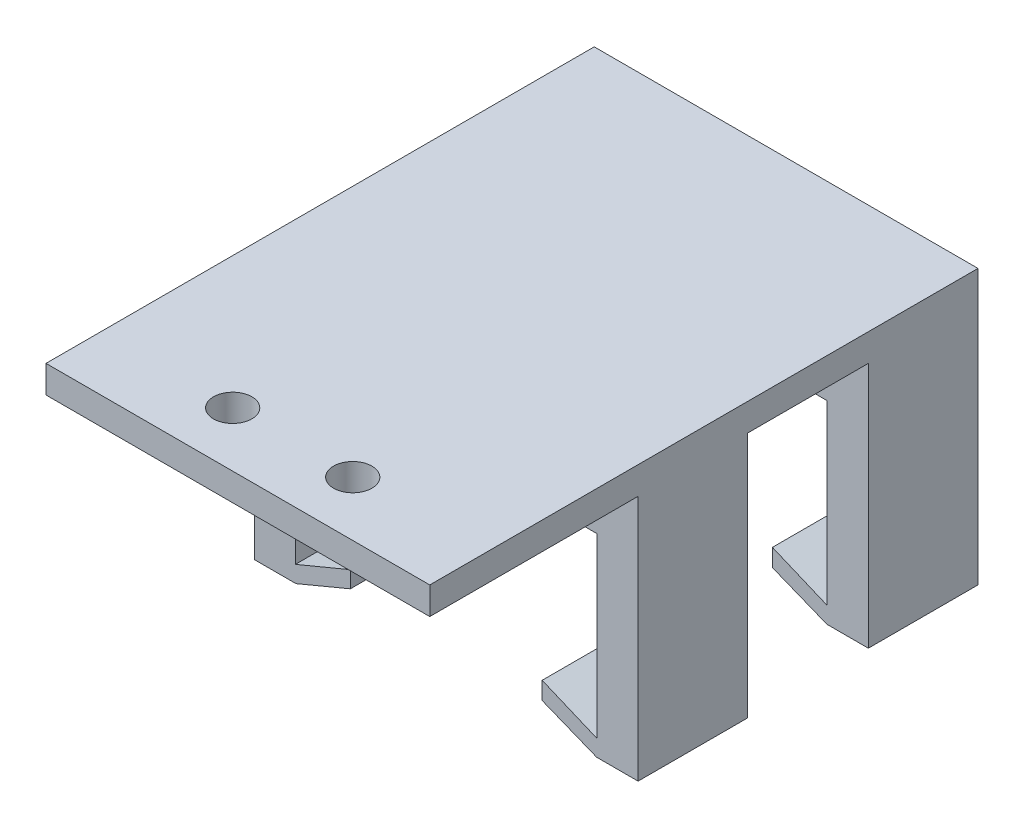
ISO-10303-21;
HEADER;
FILE_DESCRIPTION(('STEP AP214'),'2;1');
FILE_NAME('part.step','',(''),(''),'','','');
FILE_SCHEMA(('AUTOMOTIVE_DESIGN { 1 0 10303 214 1 1 1 1 }'));
ENDSEC;
DATA;
#1=APPLICATION_CONTEXT('core data for automotive mechanical design processes');
#2=APPLICATION_PROTOCOL_DEFINITION('international standard','automotive_design',2000,#1);
#3=PRODUCT_CONTEXT('',#1,'mechanical');
#4=PRODUCT('Part','Part','',(#3));
#5=PRODUCT_RELATED_PRODUCT_CATEGORY('part','',(#4));
#6=PRODUCT_DEFINITION_FORMATION('','',#4);
#7=PRODUCT_DEFINITION_CONTEXT('part definition',#1,'design');
#8=PRODUCT_DEFINITION('design','',#6,#7);
#9=PRODUCT_DEFINITION_SHAPE('','',#8);
#10=(LENGTH_UNIT() NAMED_UNIT(*) SI_UNIT(.MILLI.,.METRE.));
#11=(NAMED_UNIT(*) PLANE_ANGLE_UNIT() SI_UNIT($,.RADIAN.));
#12=(NAMED_UNIT(*) SI_UNIT($,.STERADIAN.) SOLID_ANGLE_UNIT());
#13=UNCERTAINTY_MEASURE_WITH_UNIT(LENGTH_MEASURE(1.E-05),#10,'distance_accuracy_value','');
#14=(GEOMETRIC_REPRESENTATION_CONTEXT(3) GLOBAL_UNCERTAINTY_ASSIGNED_CONTEXT((#13)) GLOBAL_UNIT_ASSIGNED_CONTEXT((#10,
#11,#12)) REPRESENTATION_CONTEXT('',''));
#15=CARTESIAN_POINT('',(0.,0.,0.));
#16=DIRECTION('',(0.,0.,1.));
#17=DIRECTION('',(1.,0.,0.));
#18=AXIS2_PLACEMENT_3D('',#15,#16,#17);
#19=CARTESIAN_POINT('',(20.2327480916031,-22.86,24.1350162162027));
#20=DIRECTION('',(1.,0.,0.));
#21=DIRECTION('',(0.,0.,-1.));
#22=AXIS2_PLACEMENT_3D('',#19,#20,#21);
#23=PLANE('',#22);
#24=DIRECTION('',(0.,0.,-1.));
#25=VECTOR('',#24,1.);
#26=CARTESIAN_POINT('',(20.2327480916031,-21.336,-12.4409837837973));
#27=LINE('',#26,#25);
#28=CARTESIAN_POINT('',(20.2327480916031,-21.336,-2.28098378379732));
#29=VERTEX_POINT('',#28);
#30=CARTESIAN_POINT('',(20.2327480916031,-21.336,-12.4409837837973));
#31=VERTEX_POINT('',#30);
#32=EDGE_CURVE('E296',#29,#31,#27,.T.);
#33=ORIENTED_EDGE('',*,*,#32,.F.);
#34=DIRECTION('',(0.,1.,0.));
#35=VECTOR('',#34,1.);
#36=CARTESIAN_POINT('',(20.2327480916031,-22.86,-2.28098378379732));
#37=LINE('',#36,#35);
#38=CARTESIAN_POINT('',(20.2327480916031,-4.9022,-2.28098378379732));
#39=VERTEX_POINT('',#38);
#40=EDGE_CURVE('E414',#29,#39,#37,.T.);
#41=ORIENTED_EDGE('',*,*,#40,.T.);
#42=DIRECTION('',(0.,0.,-1.));
#43=VECTOR('',#42,1.);
#44=CARTESIAN_POINT('',(20.2327480916031,-4.9022,24.1350162162027));
#45=LINE('',#44,#43);
#46=CARTESIAN_POINT('',(20.2327480916031,-4.9022,-12.4409837837973));
#47=VERTEX_POINT('',#46);
#48=EDGE_CURVE('E276',#39,#47,#45,.T.);
#49=ORIENTED_EDGE('',*,*,#48,.T.);
#50=DIRECTION('',(0.,1.,0.));
#51=VECTOR('',#50,1.);
#52=CARTESIAN_POINT('',(20.2327480916031,-22.86,-12.4409837837973));
#53=LINE('',#52,#51);
#54=EDGE_CURVE('E307',#31,#47,#53,.T.);
#55=ORIENTED_EDGE('',*,*,#54,.F.);
#56=EDGE_LOOP('',(#33,#41,#49,#55));
#57=FACE_BOUND('',#56,.T.);
#58=ADVANCED_FACE('F41',(#57),#23,.F.);
#59=CARTESIAN_POINT('',(-7.70725190839694,-22.86,24.1350162162027));
#60=DIRECTION('',(-1.,0.,0.));
#61=DIRECTION('',(0.,0.,1.));
#62=AXIS2_PLACEMENT_3D('',#59,#60,#61);
#63=PLANE('',#62);
#64=DIRECTION('',(0.,0.,1.));
#65=VECTOR('',#64,1.);
#66=CARTESIAN_POINT('',(-7.70725190839694,-4.9022,24.1350162162027));
#67=LINE('',#66,#65);
#68=CARTESIAN_POINT('',(-7.70725190839694,-4.9022,-12.4409837837973));
#69=VERTEX_POINT('',#68);
#70=CARTESIAN_POINT('',(-7.70725190839694,-4.9022,-2.28098378379731));
#71=VERTEX_POINT('',#70);
#72=EDGE_CURVE('E273',#69,#71,#67,.T.);
#73=ORIENTED_EDGE('',*,*,#72,.T.);
#74=DIRECTION('',(0.,-1.,0.));
#75=VECTOR('',#74,1.);
#76=CARTESIAN_POINT('',(-7.70725190839694,-22.86,-2.28098378379731));
#77=LINE('',#76,#75);
#78=CARTESIAN_POINT('',(-7.70725190839694,-21.336,-2.28098378379731));
#79=VERTEX_POINT('',#78);
#80=EDGE_CURVE('E419',#71,#79,#77,.T.);
#81=ORIENTED_EDGE('',*,*,#80,.T.);
#82=DIRECTION('',(0.,0.,1.));
#83=VECTOR('',#82,1.);
#84=CARTESIAN_POINT('',(-7.70725190839694,-21.336,24.1350162162027));
#85=LINE('',#84,#83);
#86=CARTESIAN_POINT('',(-7.70725190839694,-21.336,-12.4409837837973));
#87=VERTEX_POINT('',#86);
#88=EDGE_CURVE('E304',#87,#79,#85,.T.);
#89=ORIENTED_EDGE('',*,*,#88,.F.);
#90=DIRECTION('',(0.,1.,0.));
#91=VECTOR('',#90,1.);
#92=CARTESIAN_POINT('',(-7.70725190839694,-22.86,-12.4409837837973));
#93=LINE('',#92,#91);
#94=EDGE_CURVE('E322',#87,#69,#93,.T.);
#95=ORIENTED_EDGE('',*,*,#94,.T.);
#96=EDGE_LOOP('',(#73,#81,#89,#95));
#97=FACE_BOUND('',#96,.T.);
#98=ADVANCED_FACE('F454',(#97),#63,.F.);
#99=CARTESIAN_POINT('',(0.,-22.86,0.));
#100=DIRECTION('',(0.,-1.,0.));
#101=DIRECTION('',(0.,0.,-1.));
#102=AXIS2_PLACEMENT_3D('',#99,#100,#101);
#103=PLANE('',#102);
#104=DIRECTION('',(0.,0.,1.));
#105=VECTOR('',#104,1.);
#106=CARTESIAN_POINT('',(-7.66074574714831,-22.86,-12.4409837837973));
#107=LINE('',#106,#105);
#108=CARTESIAN_POINT('',(-7.66074574714831,-22.86,-12.4409837837973));
#109=VERTEX_POINT('',#108);
#110=CARTESIAN_POINT('',(-7.66074574714831,-22.86,-2.28098378379731));
#111=VERTEX_POINT('',#110);
#112=EDGE_CURVE('E239',#109,#111,#107,.T.);
#113=ORIENTED_EDGE('',*,*,#112,.T.);
#114=DIRECTION('',(1.,0.,0.));
#115=VECTOR('',#114,1.);
#116=CARTESIAN_POINT('',(-11.517251908397,-22.86,-2.28098378379731));
#117=LINE('',#116,#115);
#118=CARTESIAN_POINT('',(-11.517251908397,-22.86,-2.28098378379731));
#119=VERTEX_POINT('',#118);
#120=EDGE_CURVE('E391',#119,#111,#117,.T.);
#121=ORIENTED_EDGE('',*,*,#120,.F.);
#122=DIRECTION('',(0.,0.,-1.));
#123=VECTOR('',#122,1.);
#124=CARTESIAN_POINT('',(-11.5172519083969,-22.86,24.1350162162027));
#125=LINE('',#124,#123);
#126=CARTESIAN_POINT('',(-11.5172519083969,-22.86,-12.4409837837973));
#127=VERTEX_POINT('',#126);
#128=EDGE_CURVE('E316',#119,#127,#125,.T.);
#129=ORIENTED_EDGE('',*,*,#128,.T.);
#130=DIRECTION('',(1.,0.,0.));
#131=VECTOR('',#130,1.);
#132=CARTESIAN_POINT('',(-11.5172519083969,-22.86,-12.4409837837973));
#133=LINE('',#132,#131);
#134=EDGE_CURVE('E320',#127,#109,#133,.T.);
#135=ORIENTED_EDGE('',*,*,#134,.T.);
#136=EDGE_LOOP('',(#113,#121,#129,#135));
#137=FACE_BOUND('',#136,.T.);
#138=ADVANCED_FACE('F550',(#137),#103,.T.);
#139=CARTESIAN_POINT('',(0.,-22.86,0.));
#140=DIRECTION('',(0.,1.,0.));
#141=DIRECTION('',(0.,0.,1.));
#142=AXIS2_PLACEMENT_3D('',#139,#140,#141);
#143=PLANE('',#142);
#144=CARTESIAN_POINT('',(20.2048459047572,-22.86,-2.28098378379732));
#145=VERTEX_POINT('',#144);
#146=CARTESIAN_POINT('',(24.0427480916031,-22.86,-2.28098378379732));
#147=VERTEX_POINT('',#146);
#148=EDGE_CURVE('E397',#145,#147,#117,.T.);
#149=ORIENTED_EDGE('',*,*,#148,.F.);
#150=DIRECTION('',(0.,0.,1.));
#151=VECTOR('',#150,1.);
#152=CARTESIAN_POINT('',(20.2048459047573,-22.86,-12.4409837837973));
#153=LINE('',#152,#151);
#154=CARTESIAN_POINT('',(20.2048459047573,-22.86,-12.4409837837973));
#155=VERTEX_POINT('',#154);
#156=EDGE_CURVE('E56',#155,#145,#153,.T.);
#157=ORIENTED_EDGE('',*,*,#156,.F.);
#158=DIRECTION('',(1.,0.,0.));
#159=VECTOR('',#158,1.);
#160=CARTESIAN_POINT('',(24.0427480916031,-22.86,-12.4409837837973));
#161=LINE('',#160,#159);
#162=CARTESIAN_POINT('',(24.0427480916031,-22.86,-12.4409837837973));
#163=VERTEX_POINT('',#162);
#164=EDGE_CURVE('E310',#155,#163,#161,.T.);
#165=ORIENTED_EDGE('',*,*,#164,.T.);
#166=DIRECTION('',(0.,0.,1.));
#167=VECTOR('',#166,1.);
#168=CARTESIAN_POINT('',(24.0427480916031,-22.86,24.1350162162027));
#169=LINE('',#168,#167);
#170=EDGE_CURVE('E313',#163,#147,#169,.T.);
#171=ORIENTED_EDGE('',*,*,#170,.T.);
#172=EDGE_LOOP('',(#149,#157,#165,#171));
#173=FACE_BOUND('',#172,.T.);
#174=ADVANCED_FACE('F479',(#173),#143,.F.);
#175=CARTESIAN_POINT('',(15.1527480916031,0.,0.));
#176=DIRECTION('',(-1.,0.,0.));
#177=DIRECTION('',(0.,0.,1.));
#178=AXIS2_PLACEMENT_3D('',#175,#176,#177);
#179=PLANE('',#178);
#180=DIRECTION('',(0.,0.,1.));
#181=VECTOR('',#180,1.);
#182=CARTESIAN_POINT('',(15.1527480916031,-20.8346026362876,-12.4409837837973));
#183=LINE('',#182,#181);
#184=CARTESIAN_POINT('',(15.1527480916031,-20.8346026362876,-12.4409837837973));
#185=VERTEX_POINT('',#184);
#186=CARTESIAN_POINT('',(15.1527480916031,-20.8346026362876,-2.28098378379732));
#187=VERTEX_POINT('',#186);
#188=EDGE_CURVE('E471',#185,#187,#183,.T.);
#189=ORIENTED_EDGE('',*,*,#188,.T.);
#190=DIRECTION('',(0.,-1.,0.));
#191=VECTOR('',#190,1.);
#192=CARTESIAN_POINT('',(15.1527480916031,0.,-2.28098378379732));
#193=LINE('',#192,#191);
#194=CARTESIAN_POINT('',(15.1527480916031,-19.2088197799885,-2.28098378379732));
#195=VERTEX_POINT('',#194);
#196=EDGE_CURVE('E411',#195,#187,#193,.T.);
#197=ORIENTED_EDGE('',*,*,#196,.F.);
#198=DIRECTION('',(0.,0.,1.));
#199=VECTOR('',#198,1.);
#200=CARTESIAN_POINT('',(15.1527480916031,-19.2088197799885,-17.9796028196735));
#201=LINE('',#200,#199);
#202=CARTESIAN_POINT('',(15.1527480916031,-19.2088197799885,-12.4409837837973));
#203=VERTEX_POINT('',#202);
#204=EDGE_CURVE('E428',#203,#195,#201,.T.);
#205=ORIENTED_EDGE('',*,*,#204,.F.);
#206=DIRECTION('',(0.,-1.,0.));
#207=VECTOR('',#206,1.);
#208=CARTESIAN_POINT('',(15.1527480916031,-21.336,-12.4409837837973));
#209=LINE('',#208,#207);
#210=EDGE_CURVE('E297',#203,#185,#209,.T.);
#211=ORIENTED_EDGE('',*,*,#210,.T.);
#212=EDGE_LOOP('',(#189,#197,#205,#211));
#213=FACE_BOUND('',#212,.T.);
#214=ADVANCED_FACE('F470',(#213),#179,.T.);
#215=CARTESIAN_POINT('',(0.,-4.9022,0.));
#216=DIRECTION('',(0.,-1.,0.));
#217=DIRECTION('',(0.,0.,-1.));
#218=AXIS2_PLACEMENT_3D('',#215,#216,#217);
#219=PLANE('',#218);
#220=DIRECTION('',(1.,0.,0.));
#221=VECTOR('',#220,1.);
#222=CARTESIAN_POINT('',(0.,-4.9022,-2.28098378379732));
#223=LINE('',#222,#221);
#224=EDGE_CURVE('E417',#71,#39,#223,.T.);
#225=ORIENTED_EDGE('',*,*,#224,.F.);
#226=ORIENTED_EDGE('',*,*,#72,.F.);
#227=DIRECTION('',(1.,0.,0.));
#228=VECTOR('',#227,1.);
#229=CARTESIAN_POINT('',(-11.5172519083969,-4.9022,-12.4409837837973));
#230=LINE('',#229,#228);
#231=EDGE_CURVE('E260',#69,#47,#230,.T.);
#232=ORIENTED_EDGE('',*,*,#231,.T.);
#233=ORIENTED_EDGE('',*,*,#48,.F.);
#234=EDGE_LOOP('',(#225,#226,#232,#233));
#235=FACE_BOUND('',#234,.T.);
#236=ADVANCED_FACE('F457',(#235),#219,.T.);
#237=CARTESIAN_POINT('',(-7.70725190839694,-21.336,-17.9796028196735));
#238=DIRECTION('',(-0.384063284770582,0.923306770954936,0.));
#239=DIRECTION('',(-0.923306770954936,-0.384063284770582,0.));
#240=AXIS2_PLACEMENT_3D('',#237,#238,#239);
#241=PLANE('',#240);
#242=DIRECTION('',(-0.923306770954936,-0.384063284770582,0.));
#243=VECTOR('',#242,1.);
#244=CARTESIAN_POINT('',(-7.70725190839694,-21.336,-2.28098378379731));
#245=LINE('',#244,#243);
#246=CARTESIAN_POINT('',(-2.59340745083259,-19.2088197799885,-2.28098378379731));
#247=VERTEX_POINT('',#246);
#248=EDGE_CURVE('E422',#247,#79,#245,.T.);
#249=ORIENTED_EDGE('',*,*,#248,.F.);
#250=DIRECTION('',(0.,0.,1.));
#251=VECTOR('',#250,1.);
#252=CARTESIAN_POINT('',(-2.59340745083259,-19.2088197799885,-17.9796028196735));
#253=LINE('',#252,#251);
#254=CARTESIAN_POINT('',(-2.59340745083259,-19.2088197799885,-12.4409837837973));
#255=VERTEX_POINT('',#254);
#256=EDGE_CURVE('E265',#255,#247,#253,.T.);
#257=ORIENTED_EDGE('',*,*,#256,.F.);
#258=DIRECTION('',(0.923306770954936,0.384063284770582,0.));
#259=VECTOR('',#258,1.);
#260=CARTESIAN_POINT('',(-7.70725190839694,-21.336,-12.4409837837973));
#261=LINE('',#260,#259);
#262=EDGE_CURVE('E258',#87,#255,#261,.T.);
#263=ORIENTED_EDGE('',*,*,#262,.F.);
#264=ORIENTED_EDGE('',*,*,#88,.T.);
#265=EDGE_LOOP('',(#249,#257,#263,#264));
#266=FACE_BOUND('',#265,.T.);
#267=ADVANCED_FACE('F448',(#266),#241,.T.);
#268=CARTESIAN_POINT('',(-2.59340745083259,-19.2088197799885,-17.9796028196735));
#269=DIRECTION('',(0.999873452344455,-0.0159084661982286,0.));
#270=DIRECTION('',(0.0159084661982286,0.999873452344455,0.));
#271=AXIS2_PLACEMENT_3D('',#268,#269,#270);
#272=PLANE('',#271);
#273=DIRECTION('',(0.,0.,1.));
#274=VECTOR('',#273,1.);
#275=CARTESIAN_POINT('',(-2.61803547336407,-20.7567317915005,-12.4409837837973));
#276=LINE('',#275,#274);
#277=CARTESIAN_POINT('',(-2.61803547336407,-20.7567317915005,-12.4409837837973));
#278=VERTEX_POINT('',#277);
#279=CARTESIAN_POINT('',(-2.61803547336411,-20.7567317915041,-2.28098378379732));
#280=VERTEX_POINT('',#279);
#281=EDGE_CURVE('E64',#278,#280,#276,.T.);
#282=ORIENTED_EDGE('',*,*,#281,.F.);
#283=DIRECTION('',(-0.0159084661982286,-0.999873452344455,0.));
#284=VECTOR('',#283,1.);
#285=CARTESIAN_POINT('',(-2.59340745083259,-19.2088197799885,-12.4409837837973));
#286=LINE('',#285,#284);
#287=EDGE_CURVE('E252',#255,#278,#286,.T.);
#288=ORIENTED_EDGE('',*,*,#287,.F.);
#289=ORIENTED_EDGE('',*,*,#256,.T.);
#290=DIRECTION('',(0.0159084661982286,0.999873452344455,0.));
#291=VECTOR('',#290,1.);
#292=CARTESIAN_POINT('',(-2.59340745083259,-19.2088197799885,-2.28098378379732));
#293=LINE('',#292,#291);
#294=EDGE_CURVE('E253',#280,#247,#293,.T.);
#295=ORIENTED_EDGE('',*,*,#294,.F.);
#296=EDGE_LOOP('',(#282,#288,#289,#295));
#297=FACE_BOUND('',#296,.T.);
#298=ADVANCED_FACE('F250',(#297),#272,.T.);
#299=CARTESIAN_POINT('',(15.1527480916031,-19.2088197799885,-17.9796028196735));
#300=DIRECTION('',(0.386241383950928,0.922397741391246,0.));
#301=DIRECTION('',(-0.922397741391246,0.386241383950928,0.));
#302=AXIS2_PLACEMENT_3D('',#299,#300,#301);
#303=PLANE('',#302);
#304=DIRECTION('',(-0.922397741391246,0.386241383950928,0.));
#305=VECTOR('',#304,1.);
#306=CARTESIAN_POINT('',(15.1527480916031,-19.2088197799885,-2.28098378379732));
#307=LINE('',#306,#305);
#308=EDGE_CURVE('E369',#29,#195,#307,.T.);
#309=ORIENTED_EDGE('',*,*,#308,.F.);
#310=ORIENTED_EDGE('',*,*,#32,.T.);
#311=DIRECTION('',(0.922397741391246,-0.386241383950928,0.));
#312=VECTOR('',#311,1.);
#313=CARTESIAN_POINT('',(15.1527480916031,-19.2088197799885,-12.4409837837973));
#314=LINE('',#313,#312);
#315=EDGE_CURVE('E425',#203,#31,#314,.T.);
#316=ORIENTED_EDGE('',*,*,#315,.F.);
#317=ORIENTED_EDGE('',*,*,#204,.T.);
#318=EDGE_LOOP('',(#309,#310,#316,#317));
#319=FACE_BOUND('',#318,.T.);
#320=ADVANCED_FACE('F466',(#319),#303,.T.);
#321=CARTESIAN_POINT('',(0.,0.,0.));
#322=DIRECTION('',(0.,1.,0.));
#323=DIRECTION('',(0.,0.,1.));
#324=AXIS2_PLACEMENT_3D('',#321,#322,#323);
#325=PLANE('',#324);
#326=CARTESIAN_POINT('',(11.8253480916031,0.,33.2790162162027));
#327=DIRECTION('',(0.,1.,0.));
#328=DIRECTION('',(0.,0.,1.));
#329=AXIS2_PLACEMENT_3D('',#326,#327,#328);
#330=CIRCLE('',#329,1.778);
#331=CARTESIAN_POINT('',(11.8253480916031,0.,35.0570162162027));
#332=VERTEX_POINT('',#331);
#333=EDGE_CURVE('E325',#332,#332,#330,.T.);
#334=ORIENTED_EDGE('',*,*,#333,.T.);
#335=EDGE_LOOP('',(#334));
#336=FACE_BOUND('',#335,.T.);
#337=CARTESIAN_POINT('',(0.700148091603065,0.,33.2790162162027));
#338=DIRECTION('',(0.,1.,0.));
#339=DIRECTION('',(0.,0.,1.));
#340=AXIS2_PLACEMENT_3D('',#337,#338,#339);
#341=CIRCLE('',#340,1.778);
#342=CARTESIAN_POINT('',(0.700148091603065,0.,35.0570162162027));
#343=VERTEX_POINT('',#342);
#344=EDGE_CURVE('E329',#343,#343,#341,.T.);
#345=ORIENTED_EDGE('',*,*,#344,.T.);
#346=EDGE_LOOP('',(#345));
#347=FACE_BOUND('',#346,.T.);
#348=DIRECTION('',(0.,0.,1.));
#349=VECTOR('',#348,1.);
#350=CARTESIAN_POINT('',(-11.5172519083969,0.,-12.4409837837973));
#351=LINE('',#350,#349);
#352=CARTESIAN_POINT('',(-11.5172519083969,0.,19.0550162162027));
#353=VERTEX_POINT('',#352);
#354=CARTESIAN_POINT('',(-11.5172519083969,0.,38.3590162162027));
#355=VERTEX_POINT('',#354);
#356=EDGE_CURVE('E335',#353,#355,#351,.T.);
#357=ORIENTED_EDGE('',*,*,#356,.F.);
#358=DIRECTION('',(-1.,0.,0.));
#359=VECTOR('',#358,1.);
#360=CARTESIAN_POINT('',(-11.5172519083969,0.,19.0550162162027));
#361=LINE('',#360,#359);
#362=CARTESIAN_POINT('',(24.0427480916031,0.,19.0550162162027));
#363=VERTEX_POINT('',#362);
#364=EDGE_CURVE('E288',#363,#353,#361,.T.);
#365=ORIENTED_EDGE('',*,*,#364,.F.);
#366=DIRECTION('',(0.,0.,-1.));
#367=VECTOR('',#366,1.);
#368=CARTESIAN_POINT('',(24.0427480916031,0.,-12.4409837837973));
#369=LINE('',#368,#367);
#370=CARTESIAN_POINT('',(24.0427480916031,0.,38.3590162162027));
#371=VERTEX_POINT('',#370);
#372=EDGE_CURVE('E342',#371,#363,#369,.T.);
#373=ORIENTED_EDGE('',*,*,#372,.F.);
#374=DIRECTION('',(1.,0.,0.));
#375=VECTOR('',#374,1.);
#376=CARTESIAN_POINT('',(-11.5172519083969,0.,38.3590162162027));
#377=LINE('',#376,#375);
#378=EDGE_CURVE('E350',#355,#371,#377,.T.);
#379=ORIENTED_EDGE('',*,*,#378,.F.);
#380=EDGE_LOOP('',(#357,#365,#373,#379));
#381=FACE_BOUND('',#380,.T.);
#382=ADVANCED_FACE('F539',(#336,#347,#381),#325,.F.);
#383=CARTESIAN_POINT('',(20.2327480916031,-4.9022,19.0550162162027));
#384=VERTEX_POINT('',#383);
#385=CARTESIAN_POINT('',(20.2327480916031,-4.9022,8.89501621620267));
#386=VERTEX_POINT('',#385);
#387=EDGE_CURVE('E277',#384,#386,#45,.T.);
#388=ORIENTED_EDGE('',*,*,#387,.T.);
#389=DIRECTION('',(0.,-1.,0.));
#390=VECTOR('',#389,1.);
#391=CARTESIAN_POINT('',(20.2327480916031,-22.86,8.89501621620267));
#392=LINE('',#391,#390);
#393=CARTESIAN_POINT('',(20.2327480916031,-21.336,8.89501621620267));
#394=VERTEX_POINT('',#393);
#395=EDGE_CURVE('E390',#386,#394,#392,.T.);
#396=ORIENTED_EDGE('',*,*,#395,.T.);
#397=CARTESIAN_POINT('',(20.2327480916031,-21.336,19.0550162162027));
#398=VERTEX_POINT('',#397);
#399=EDGE_CURVE('E301',#398,#394,#27,.T.);
#400=ORIENTED_EDGE('',*,*,#399,.F.);
#401=DIRECTION('',(0.,-1.,0.));
#402=VECTOR('',#401,1.);
#403=CARTESIAN_POINT('',(20.2327480916031,-22.86,19.0550162162027));
#404=LINE('',#403,#402);
#405=EDGE_CURVE('E290',#384,#398,#404,.T.);
#406=ORIENTED_EDGE('',*,*,#405,.F.);
#407=EDGE_LOOP('',(#388,#396,#400,#406));
#408=FACE_BOUND('',#407,.T.);
#409=ADVANCED_FACE('F566',(#408),#23,.F.);
#410=CARTESIAN_POINT('',(-7.70725190839694,-21.336,8.89501621620268));
#411=VERTEX_POINT('',#410);
#412=CARTESIAN_POINT('',(-7.70725190839694,-21.336,19.0550162162027));
#413=VERTEX_POINT('',#412);
#414=EDGE_CURVE('E300',#411,#413,#85,.T.);
#415=ORIENTED_EDGE('',*,*,#414,.F.);
#416=DIRECTION('',(0.,1.,0.));
#417=VECTOR('',#416,1.);
#418=CARTESIAN_POINT('',(-7.70725190839694,-22.86,8.89501621620268));
#419=LINE('',#418,#417);
#420=CARTESIAN_POINT('',(-7.70725190839694,-4.9022,8.89501621620268));
#421=VERTEX_POINT('',#420);
#422=EDGE_CURVE('E404',#411,#421,#419,.T.);
#423=ORIENTED_EDGE('',*,*,#422,.T.);
#424=CARTESIAN_POINT('',(-7.70725190839694,-4.9022,19.0550162162027));
#425=VERTEX_POINT('',#424);
#426=EDGE_CURVE('E272',#421,#425,#67,.T.);
#427=ORIENTED_EDGE('',*,*,#426,.T.);
#428=DIRECTION('',(0.,1.,0.));
#429=VECTOR('',#428,1.);
#430=CARTESIAN_POINT('',(-7.70725190839694,-22.86,19.0550162162027));
#431=LINE('',#430,#429);
#432=EDGE_CURVE('E293',#413,#425,#431,.T.);
#433=ORIENTED_EDGE('',*,*,#432,.F.);
#434=EDGE_LOOP('',(#415,#423,#427,#433));
#435=FACE_BOUND('',#434,.T.);
#436=ADVANCED_FACE('F559',(#435),#63,.F.);
#437=CARTESIAN_POINT('',(-7.66074574714831,-22.86,8.89501621620268));
#438=VERTEX_POINT('',#437);
#439=CARTESIAN_POINT('',(-7.66074574714831,-22.86,19.0550162162027));
#440=VERTEX_POINT('',#439);
#441=EDGE_CURVE('E254',#438,#440,#107,.T.);
#442=ORIENTED_EDGE('',*,*,#441,.T.);
#443=DIRECTION('',(1.,0.,0.));
#444=VECTOR('',#443,1.);
#445=CARTESIAN_POINT('',(-11.5172519083969,-22.86,19.0550162162027));
#446=LINE('',#445,#444);
#447=CARTESIAN_POINT('',(-11.5172519083969,-22.86,19.0550162162027));
#448=VERTEX_POINT('',#447);
#449=EDGE_CURVE('E283',#448,#440,#446,.T.);
#450=ORIENTED_EDGE('',*,*,#449,.F.);
#451=CARTESIAN_POINT('',(-11.5172519083969,-22.86,8.89501621620268));
#452=VERTEX_POINT('',#451);
#453=EDGE_CURVE('E317',#448,#452,#125,.T.);
#454=ORIENTED_EDGE('',*,*,#453,.T.);
#455=DIRECTION('',(1.,0.,0.));
#456=VECTOR('',#455,1.);
#457=CARTESIAN_POINT('',(-11.5172519083969,-22.86,8.89501621620268));
#458=LINE('',#457,#456);
#459=EDGE_CURVE('E482',#452,#438,#458,.T.);
#460=ORIENTED_EDGE('',*,*,#459,.T.);
#461=EDGE_LOOP('',(#442,#450,#454,#460));
#462=FACE_BOUND('',#461,.T.);
#463=ADVANCED_FACE('F529',(#462),#103,.T.);
#464=CARTESIAN_POINT('',(20.2048459047573,-22.86,19.0550162162027));
#465=VERTEX_POINT('',#464);
#466=CARTESIAN_POINT('',(24.0427480916031,-22.86,19.0550162162027));
#467=VERTEX_POINT('',#466);
#468=EDGE_CURVE('E282',#465,#467,#446,.T.);
#469=ORIENTED_EDGE('',*,*,#468,.F.);
#470=CARTESIAN_POINT('',(20.2048459047573,-22.86,8.89501621620267));
#471=VERTEX_POINT('',#470);
#472=EDGE_CURVE('E519',#471,#465,#153,.T.);
#473=ORIENTED_EDGE('',*,*,#472,.F.);
#474=CARTESIAN_POINT('',(24.0427480916031,-22.86,8.89501621620267));
#475=VERTEX_POINT('',#474);
#476=EDGE_CURVE('E379',#471,#475,#458,.T.);
#477=ORIENTED_EDGE('',*,*,#476,.T.);
#478=EDGE_CURVE('E312',#475,#467,#169,.T.);
#479=ORIENTED_EDGE('',*,*,#478,.T.);
#480=EDGE_LOOP('',(#469,#473,#477,#479));
#481=FACE_BOUND('',#480,.T.);
#482=ADVANCED_FACE('F573',(#481),#143,.F.);
#483=CARTESIAN_POINT('',(15.1527480916031,-20.8346026362876,8.89501621620267));
#484=VERTEX_POINT('',#483);
#485=CARTESIAN_POINT('',(15.1527480916031,-20.8346026362876,19.0550162162027));
#486=VERTEX_POINT('',#485);
#487=EDGE_CURVE('E386',#484,#486,#183,.T.);
#488=ORIENTED_EDGE('',*,*,#487,.T.);
#489=DIRECTION('',(0.,1.,0.));
#490=VECTOR('',#489,1.);
#491=CARTESIAN_POINT('',(15.1527480916031,0.,19.0550162162027));
#492=LINE('',#491,#490);
#493=CARTESIAN_POINT('',(15.1527480916031,-19.2088197799885,19.0550162162027));
#494=VERTEX_POINT('',#493);
#495=EDGE_CURVE('E365',#486,#494,#492,.T.);
#496=ORIENTED_EDGE('',*,*,#495,.T.);
#497=CARTESIAN_POINT('',(15.1527480916031,-19.2088197799885,8.89501621620267));
#498=VERTEX_POINT('',#497);
#499=EDGE_CURVE('E389',#498,#494,#201,.T.);
#500=ORIENTED_EDGE('',*,*,#499,.F.);
#501=DIRECTION('',(0.,1.,0.));
#502=VECTOR('',#501,1.);
#503=CARTESIAN_POINT('',(15.1527480916031,0.,8.89501621620267));
#504=LINE('',#503,#502);
#505=EDGE_CURVE('E376',#484,#498,#504,.T.);
#506=ORIENTED_EDGE('',*,*,#505,.F.);
#507=EDGE_LOOP('',(#488,#496,#500,#506));
#508=FACE_BOUND('',#507,.T.);
#509=ADVANCED_FACE('F385',(#508),#179,.T.);
#510=CARTESIAN_POINT('',(0.,2.54,0.));
#511=DIRECTION('',(0.,1.,0.));
#512=DIRECTION('',(0.,0.,1.));
#513=AXIS2_PLACEMENT_3D('',#510,#511,#512);
#514=PLANE('',#513);
#515=CARTESIAN_POINT('',(0.700148091603065,2.54,33.2790162162027));
#516=DIRECTION('',(0.,1.,0.));
#517=DIRECTION('',(0.,0.,1.));
#518=AXIS2_PLACEMENT_3D('',#515,#516,#517);
#519=CIRCLE('',#518,1.778);
#520=CARTESIAN_POINT('',(0.700148091603065,2.54,35.0570162162027));
#521=VERTEX_POINT('',#520);
#522=EDGE_CURVE('E332',#521,#521,#519,.T.);
#523=ORIENTED_EDGE('',*,*,#522,.F.);
#524=EDGE_LOOP('',(#523));
#525=FACE_BOUND('',#524,.T.);
#526=DIRECTION('',(0.,0.,1.));
#527=VECTOR('',#526,1.);
#528=CARTESIAN_POINT('',(-11.5172519083969,2.54,-12.4409837837973));
#529=LINE('',#528,#527);
#530=CARTESIAN_POINT('',(-11.5172519083969,2.54,-12.4409837837973));
#531=VERTEX_POINT('',#530);
#532=CARTESIAN_POINT('',(-11.5172519083969,2.54,38.3590162162027));
#533=VERTEX_POINT('',#532);
#534=EDGE_CURVE('E338',#531,#533,#529,.T.);
#535=ORIENTED_EDGE('',*,*,#534,.T.);
#536=DIRECTION('',(1.,0.,0.));
#537=VECTOR('',#536,1.);
#538=CARTESIAN_POINT('',(-11.5172519083969,2.54,38.3590162162027));
#539=LINE('',#538,#537);
#540=CARTESIAN_POINT('',(24.0427480916031,2.54,38.3590162162027));
#541=VERTEX_POINT('',#540);
#542=EDGE_CURVE('E341',#533,#541,#539,.T.);
#543=ORIENTED_EDGE('',*,*,#542,.T.);
#544=DIRECTION('',(0.,0.,-1.));
#545=VECTOR('',#544,1.);
#546=CARTESIAN_POINT('',(24.0427480916031,2.54,-12.4409837837973));
#547=LINE('',#546,#545);
#548=CARTESIAN_POINT('',(24.0427480916031,2.54,-12.4409837837973));
#549=VERTEX_POINT('',#548);
#550=EDGE_CURVE('E344',#541,#549,#547,.T.);
#551=ORIENTED_EDGE('',*,*,#550,.T.);
#552=DIRECTION('',(-1.,0.,0.));
#553=VECTOR('',#552,1.);
#554=CARTESIAN_POINT('',(-11.5172519083969,2.54,-12.4409837837973));
#555=LINE('',#554,#553);
#556=EDGE_CURVE('E346',#549,#531,#555,.T.);
#557=ORIENTED_EDGE('',*,*,#556,.T.);
#558=EDGE_LOOP('',(#535,#543,#551,#557));
#559=FACE_BOUND('',#558,.T.);
#560=CARTESIAN_POINT('',(11.8253480916031,2.54,33.2790162162027));
#561=DIRECTION('',(0.,1.,0.));
#562=DIRECTION('',(0.,0.,1.));
#563=AXIS2_PLACEMENT_3D('',#560,#561,#562);
#564=CIRCLE('',#563,1.778);
#565=CARTESIAN_POINT('',(11.8253480916031,2.54,35.0570162162027));
#566=VERTEX_POINT('',#565);
#567=EDGE_CURVE('E326',#566,#566,#564,.T.);
#568=ORIENTED_EDGE('',*,*,#567,.F.);
#569=EDGE_LOOP('',(#568));
#570=FACE_BOUND('',#569,.T.);
#571=ADVANCED_FACE('F545',(#525,#559,#570),#514,.T.);
#572=CARTESIAN_POINT('',(-11.5172519083969,2.54,-12.4409837837973));
#573=DIRECTION('',(1.,0.,0.));
#574=DIRECTION('',(0.,0.,-1.));
#575=AXIS2_PLACEMENT_3D('',#572,#573,#574);
#576=PLANE('',#575);
#577=ORIENTED_EDGE('',*,*,#128,.F.);
#578=DIRECTION('',(0.,1.,0.));
#579=VECTOR('',#578,1.);
#580=CARTESIAN_POINT('',(-11.517251908397,-22.86,-2.28098378379731));
#581=LINE('',#580,#579);
#582=CARTESIAN_POINT('',(-11.517251908397,0.,-2.28098378379731));
#583=VERTEX_POINT('',#582);
#584=EDGE_CURVE('E500',#119,#583,#581,.T.);
#585=ORIENTED_EDGE('',*,*,#584,.T.);
#586=DIRECTION('',(0.,0.,1.));
#587=VECTOR('',#586,1.);
#588=CARTESIAN_POINT('',(-11.517251908397,0.,-2.28098378379731));
#589=LINE('',#588,#587);
#590=CARTESIAN_POINT('',(-11.5172519083969,0.,8.89501621620268));
#591=VERTEX_POINT('',#590);
#592=EDGE_CURVE('E495',#583,#591,#589,.T.);
#593=ORIENTED_EDGE('',*,*,#592,.T.);
#594=DIRECTION('',(0.,-1.,0.));
#595=VECTOR('',#594,1.);
#596=CARTESIAN_POINT('',(-11.5172519083969,-22.86,8.89501621620268));
#597=LINE('',#596,#595);
#598=EDGE_CURVE('E491',#591,#452,#597,.T.);
#599=ORIENTED_EDGE('',*,*,#598,.T.);
#600=ORIENTED_EDGE('',*,*,#453,.F.);
#601=DIRECTION('',(0.,-1.,0.));
#602=VECTOR('',#601,1.);
#603=CARTESIAN_POINT('',(-11.5172519083969,0.,19.0550162162027));
#604=LINE('',#603,#602);
#605=EDGE_CURVE('E280',#353,#448,#604,.T.);
#606=ORIENTED_EDGE('',*,*,#605,.F.);
#607=ORIENTED_EDGE('',*,*,#356,.T.);
#608=DIRECTION('',(0.,-1.,0.));
#609=VECTOR('',#608,1.);
#610=CARTESIAN_POINT('',(-11.5172519083969,2.54,38.3590162162027));
#611=LINE('',#610,#609);
#612=EDGE_CURVE('E362',#533,#355,#611,.T.);
#613=ORIENTED_EDGE('',*,*,#612,.F.);
#614=ORIENTED_EDGE('',*,*,#534,.F.);
#615=DIRECTION('',(0.,-1.,0.));
#616=VECTOR('',#615,1.);
#617=CARTESIAN_POINT('',(-11.5172519083969,2.54,-12.4409837837973));
#618=LINE('',#617,#616);
#619=EDGE_CURVE('E348',#531,#127,#618,.T.);
#620=ORIENTED_EDGE('',*,*,#619,.T.);
#621=EDGE_LOOP('',(#577,#585,#593,#599,#600,#606,#607,#613,#614,#620));
#622=FACE_BOUND('',#621,.T.);
#623=ADVANCED_FACE('F43',(#622),#576,.F.);
#624=CARTESIAN_POINT('',(-11.5172519083969,2.54,38.3590162162027));
#625=DIRECTION('',(0.,0.,-1.));
#626=DIRECTION('',(-1.,0.,0.));
#627=AXIS2_PLACEMENT_3D('',#624,#625,#626);
#628=PLANE('',#627);
#629=ORIENTED_EDGE('',*,*,#378,.T.);
#630=DIRECTION('',(0.,-1.,0.));
#631=VECTOR('',#630,1.);
#632=CARTESIAN_POINT('',(24.0427480916031,2.54,38.3590162162027));
#633=LINE('',#632,#631);
#634=EDGE_CURVE('E359',#541,#371,#633,.T.);
#635=ORIENTED_EDGE('',*,*,#634,.F.);
#636=ORIENTED_EDGE('',*,*,#542,.F.);
#637=ORIENTED_EDGE('',*,*,#612,.T.);
#638=EDGE_LOOP('',(#629,#635,#636,#637));
#639=FACE_BOUND('',#638,.T.);
#640=ADVANCED_FACE('F542',(#639),#628,.F.);
#641=CARTESIAN_POINT('',(24.0427480916031,2.54,-12.4409837837973));
#642=DIRECTION('',(-1.,0.,0.));
#643=DIRECTION('',(0.,0.,1.));
#644=AXIS2_PLACEMENT_3D('',#641,#642,#643);
#645=PLANE('',#644);
#646=DIRECTION('',(0.,0.,1.));
#647=VECTOR('',#646,1.);
#648=CARTESIAN_POINT('',(24.0427480916031,0.,-2.28098378379732));
#649=LINE('',#648,#647);
#650=CARTESIAN_POINT('',(24.0427480916031,0.,-2.28098378379732));
#651=VERTEX_POINT('',#650);
#652=CARTESIAN_POINT('',(24.0427480916031,0.,8.89501621620267));
#653=VERTEX_POINT('',#652);
#654=EDGE_CURVE('E505',#651,#653,#649,.T.);
#655=ORIENTED_EDGE('',*,*,#654,.F.);
#656=DIRECTION('',(0.,1.,0.));
#657=VECTOR('',#656,1.);
#658=CARTESIAN_POINT('',(24.0427480916031,-22.86,-2.28098378379732));
#659=LINE('',#658,#657);
#660=EDGE_CURVE('E504',#147,#651,#659,.T.);
#661=ORIENTED_EDGE('',*,*,#660,.F.);
#662=ORIENTED_EDGE('',*,*,#170,.F.);
#663=DIRECTION('',(0.,-1.,0.));
#664=VECTOR('',#663,1.);
#665=CARTESIAN_POINT('',(24.0427480916031,2.54,-12.4409837837973));
#666=LINE('',#665,#664);
#667=EDGE_CURVE('E356',#549,#163,#666,.T.);
#668=ORIENTED_EDGE('',*,*,#667,.F.);
#669=ORIENTED_EDGE('',*,*,#550,.F.);
#670=ORIENTED_EDGE('',*,*,#634,.T.);
#671=ORIENTED_EDGE('',*,*,#372,.T.);
#672=DIRECTION('',(0.,1.,0.));
#673=VECTOR('',#672,1.);
#674=CARTESIAN_POINT('',(24.0427480916031,0.,19.0550162162027));
#675=LINE('',#674,#673);
#676=EDGE_CURVE('E286',#467,#363,#675,.T.);
#677=ORIENTED_EDGE('',*,*,#676,.F.);
#678=ORIENTED_EDGE('',*,*,#478,.F.);
#679=DIRECTION('',(0.,-1.,0.));
#680=VECTOR('',#679,1.);
#681=CARTESIAN_POINT('',(24.0427480916031,-22.86,8.89501621620267));
#682=LINE('',#681,#680);
#683=EDGE_CURVE('E486',#653,#475,#682,.T.);
#684=ORIENTED_EDGE('',*,*,#683,.F.);
#685=EDGE_LOOP('',(#655,#661,#662,#668,#669,#670,#671,#677,#678,#684));
#686=FACE_BOUND('',#685,.T.);
#687=ADVANCED_FACE('F576',(#686),#645,.F.);
#688=CARTESIAN_POINT('',(-11.5172519083969,2.54,-12.4409837837973));
#689=DIRECTION('',(0.,0.,1.));
#690=DIRECTION('',(1.,0.,0.));
#691=AXIS2_PLACEMENT_3D('',#688,#689,#690);
#692=PLANE('',#691);
#693=ORIENTED_EDGE('',*,*,#287,.T.);
#694=DIRECTION('',(-0.922937877429282,-0.384948924412487,0.));
#695=VECTOR('',#694,1.);
#696=CARTESIAN_POINT('',(-7.66074574714831,-22.86,-12.4409837837973));
#697=LINE('',#696,#695);
#698=EDGE_CURVE('E236',#278,#109,#697,.T.);
#699=ORIENTED_EDGE('',*,*,#698,.T.);
#700=ORIENTED_EDGE('',*,*,#134,.F.);
#701=ORIENTED_EDGE('',*,*,#619,.F.);
#702=ORIENTED_EDGE('',*,*,#556,.F.);
#703=ORIENTED_EDGE('',*,*,#667,.T.);
#704=ORIENTED_EDGE('',*,*,#164,.F.);
#705=DIRECTION('',(-0.928187632897221,0.372112507363907,0.));
#706=VECTOR('',#705,1.);
#707=CARTESIAN_POINT('',(20.2048459047573,-22.86,-12.4409837837973));
#708=LINE('',#707,#706);
#709=EDGE_CURVE('E513',#155,#185,#708,.T.);
#710=ORIENTED_EDGE('',*,*,#709,.T.);
#711=ORIENTED_EDGE('',*,*,#210,.F.);
#712=ORIENTED_EDGE('',*,*,#315,.T.);
#713=ORIENTED_EDGE('',*,*,#54,.T.);
#714=ORIENTED_EDGE('',*,*,#231,.F.);
#715=ORIENTED_EDGE('',*,*,#94,.F.);
#716=ORIENTED_EDGE('',*,*,#262,.T.);
#717=EDGE_LOOP('',(#693,#699,#700,#701,#702,#703,#704,#710,#711,#712,#713,#714,#715,#716));
#718=FACE_BOUND('',#717,.T.);
#719=ADVANCED_FACE('F256',(#718),#692,.F.);
#720=CARTESIAN_POINT('',(0.700148091603065,2.54,33.2790162162027));
#721=DIRECTION('',(0.,-1.,0.));
#722=DIRECTION('',(0.,0.,-1.));
#723=AXIS2_PLACEMENT_3D('',#720,#721,#722);
#724=CYLINDRICAL_SURFACE('',#723,1.778);
#725=ORIENTED_EDGE('',*,*,#522,.T.);
#726=EDGE_LOOP('',(#725));
#727=FACE_BOUND('',#726,.T.);
#728=ORIENTED_EDGE('',*,*,#344,.F.);
#729=EDGE_LOOP('',(#728));
#730=FACE_BOUND('',#729,.T.);
#731=ADVANCED_FACE('F614',(#727,#730),#724,.F.);
#732=CARTESIAN_POINT('',(11.8253480916031,2.54,33.2790162162027));
#733=DIRECTION('',(0.,-1.,0.));
#734=DIRECTION('',(0.,0.,-1.));
#735=AXIS2_PLACEMENT_3D('',#732,#733,#734);
#736=CYLINDRICAL_SURFACE('',#735,1.778);
#737=ORIENTED_EDGE('',*,*,#567,.T.);
#738=EDGE_LOOP('',(#737));
#739=FACE_BOUND('',#738,.T.);
#740=ORIENTED_EDGE('',*,*,#333,.F.);
#741=EDGE_LOOP('',(#740));
#742=FACE_BOUND('',#741,.T.);
#743=ADVANCED_FACE('F631',(#739,#742),#736,.F.);
#744=CARTESIAN_POINT('',(0.,0.,19.0550162162027));
#745=DIRECTION('',(0.,0.,1.));
#746=DIRECTION('',(1.,0.,0.));
#747=AXIS2_PLACEMENT_3D('',#744,#745,#746);
#748=PLANE('',#747);
#749=DIRECTION('',(-0.922937877429282,-0.384948924412487,0.));
#750=VECTOR('',#749,1.);
#751=CARTESIAN_POINT('',(-7.66074574714831,-22.86,19.0550162162027));
#752=LINE('',#751,#750);
#753=CARTESIAN_POINT('',(-2.61803547336407,-20.7567317915005,19.0550162162027));
#754=VERTEX_POINT('',#753);
#755=EDGE_CURVE('E245',#754,#440,#752,.T.);
#756=ORIENTED_EDGE('',*,*,#755,.F.);
#757=DIRECTION('',(0.0159084661982286,0.999873452344455,0.));
#758=VECTOR('',#757,1.);
#759=CARTESIAN_POINT('',(-2.59340745083259,-19.2088197799885,19.0550162162027));
#760=LINE('',#759,#758);
#761=CARTESIAN_POINT('',(-2.59340745083259,-19.2088197799885,19.0550162162027));
#762=VERTEX_POINT('',#761);
#763=EDGE_CURVE('E433',#754,#762,#760,.T.);
#764=ORIENTED_EDGE('',*,*,#763,.T.);
#765=DIRECTION('',(-0.923306770954936,-0.384063284770582,0.));
#766=VECTOR('',#765,1.);
#767=CARTESIAN_POINT('',(-7.70725190839694,-21.336,19.0550162162027));
#768=LINE('',#767,#766);
#769=EDGE_CURVE('E435',#762,#413,#768,.T.);
#770=ORIENTED_EDGE('',*,*,#769,.T.);
#771=ORIENTED_EDGE('',*,*,#432,.T.);
#772=DIRECTION('',(-1.,0.,0.));
#773=VECTOR('',#772,1.);
#774=CARTESIAN_POINT('',(-11.5172519083969,-4.9022,19.0550162162027));
#775=LINE('',#774,#773);
#776=EDGE_CURVE('E263',#384,#425,#775,.T.);
#777=ORIENTED_EDGE('',*,*,#776,.F.);
#778=ORIENTED_EDGE('',*,*,#405,.T.);
#779=DIRECTION('',(-0.922397741391246,0.386241383950928,0.));
#780=VECTOR('',#779,1.);
#781=CARTESIAN_POINT('',(15.1527480916031,-19.2088197799885,19.0550162162027));
#782=LINE('',#781,#780);
#783=EDGE_CURVE('E431',#398,#494,#782,.T.);
#784=ORIENTED_EDGE('',*,*,#783,.T.);
#785=ORIENTED_EDGE('',*,*,#495,.F.);
#786=DIRECTION('',(-0.928187632897221,0.372112507363907,0.));
#787=VECTOR('',#786,1.);
#788=CARTESIAN_POINT('',(20.2048459047573,-22.86,19.0550162162027));
#789=LINE('',#788,#787);
#790=EDGE_CURVE('E516',#465,#486,#789,.T.);
#791=ORIENTED_EDGE('',*,*,#790,.F.);
#792=ORIENTED_EDGE('',*,*,#468,.T.);
#793=ORIENTED_EDGE('',*,*,#676,.T.);
#794=ORIENTED_EDGE('',*,*,#364,.T.);
#795=ORIENTED_EDGE('',*,*,#605,.T.);
#796=ORIENTED_EDGE('',*,*,#449,.T.);
#797=EDGE_LOOP('',(#756,#764,#770,#771,#777,#778,#784,#785,#791,#792,#793,#794,#795,#796));
#798=FACE_BOUND('',#797,.T.);
#799=ADVANCED_FACE('F530',(#798),#748,.T.);
#800=DIRECTION('',(-1.,0.,0.));
#801=VECTOR('',#800,1.);
#802=CARTESIAN_POINT('',(0.,-4.9022,8.89501621620268));
#803=LINE('',#802,#801);
#804=EDGE_CURVE('E394',#386,#421,#803,.T.);
#805=ORIENTED_EDGE('',*,*,#804,.F.);
#806=ORIENTED_EDGE('',*,*,#387,.F.);
#807=ORIENTED_EDGE('',*,*,#776,.T.);
#808=ORIENTED_EDGE('',*,*,#426,.F.);
#809=EDGE_LOOP('',(#805,#806,#807,#808));
#810=FACE_BOUND('',#809,.T.);
#811=ADVANCED_FACE('F668',(#810),#219,.T.);
#812=DIRECTION('',(0.923306770954936,0.384063284770582,0.));
#813=VECTOR('',#812,1.);
#814=CARTESIAN_POINT('',(-7.70725190839694,-21.336,8.89501621620268));
#815=LINE('',#814,#813);
#816=CARTESIAN_POINT('',(-2.59340745083259,-19.2088197799885,8.89501621620268));
#817=VERTEX_POINT('',#816);
#818=EDGE_CURVE('E407',#411,#817,#815,.T.);
#819=ORIENTED_EDGE('',*,*,#818,.F.);
#820=ORIENTED_EDGE('',*,*,#414,.T.);
#821=ORIENTED_EDGE('',*,*,#769,.F.);
#822=EDGE_CURVE('E437',#817,#762,#253,.T.);
#823=ORIENTED_EDGE('',*,*,#822,.F.);
#824=EDGE_LOOP('',(#819,#820,#821,#823));
#825=FACE_BOUND('',#824,.T.);
#826=ADVANCED_FACE('F556',(#825),#241,.T.);
#827=CARTESIAN_POINT('',(-2.61803547336407,-20.7567317915005,8.89501621620268));
#828=VERTEX_POINT('',#827);
#829=EDGE_CURVE('E244',#828,#754,#276,.T.);
#830=ORIENTED_EDGE('',*,*,#829,.F.);
#831=DIRECTION('',(-0.0159084661982286,-0.999873452344455,0.));
#832=VECTOR('',#831,1.);
#833=CARTESIAN_POINT('',(-2.59340745083259,-19.2088197799885,8.89501621620268));
#834=LINE('',#833,#832);
#835=EDGE_CURVE('E409',#817,#828,#834,.T.);
#836=ORIENTED_EDGE('',*,*,#835,.F.);
#837=ORIENTED_EDGE('',*,*,#822,.T.);
#838=ORIENTED_EDGE('',*,*,#763,.F.);
#839=EDGE_LOOP('',(#830,#836,#837,#838));
#840=FACE_BOUND('',#839,.T.);
#841=ADVANCED_FACE('F553',(#840),#272,.T.);
#842=DIRECTION('',(0.922397741391246,-0.386241383950928,0.));
#843=VECTOR('',#842,1.);
#844=CARTESIAN_POINT('',(15.1527480916031,-19.2088197799885,8.89501621620267));
#845=LINE('',#844,#843);
#846=EDGE_CURVE('E367',#498,#394,#845,.T.);
#847=ORIENTED_EDGE('',*,*,#846,.F.);
#848=ORIENTED_EDGE('',*,*,#499,.T.);
#849=ORIENTED_EDGE('',*,*,#783,.F.);
#850=ORIENTED_EDGE('',*,*,#399,.T.);
#851=EDGE_LOOP('',(#847,#848,#849,#850));
#852=FACE_BOUND('',#851,.T.);
#853=ADVANCED_FACE('F568',(#852),#303,.T.);
#854=CARTESIAN_POINT('',(-11.517251908397,-22.86,-2.28098378379731));
#855=DIRECTION('',(0.,0.,-1.));
#856=DIRECTION('',(-1.,0.,0.));
#857=AXIS2_PLACEMENT_3D('',#854,#855,#856);
#858=PLANE('',#857);
#859=ORIENTED_EDGE('',*,*,#120,.T.);
#860=DIRECTION('',(0.922937877429283,0.384948924412487,0.));
#861=VECTOR('',#860,1.);
#862=CARTESIAN_POINT('',(-10.9457729420402,-24.230154716005,-2.28098378379731));
#863=LINE('',#862,#861);
#864=EDGE_CURVE('E476',#111,#280,#863,.T.);
#865=ORIENTED_EDGE('',*,*,#864,.T.);
#866=ORIENTED_EDGE('',*,*,#294,.T.);
#867=ORIENTED_EDGE('',*,*,#248,.T.);
#868=ORIENTED_EDGE('',*,*,#80,.F.);
#869=ORIENTED_EDGE('',*,*,#224,.T.);
#870=ORIENTED_EDGE('',*,*,#40,.F.);
#871=ORIENTED_EDGE('',*,*,#308,.T.);
#872=ORIENTED_EDGE('',*,*,#196,.T.);
#873=DIRECTION('',(0.928187632897221,-0.372112507363907,0.));
#874=VECTOR('',#873,1.);
#875=CARTESIAN_POINT('',(-7.12476540970177,-11.9034974232948,-2.28098378379731));
#876=LINE('',#875,#874);
#877=EDGE_CURVE('E472',#187,#145,#876,.T.);
#878=ORIENTED_EDGE('',*,*,#877,.T.);
#879=ORIENTED_EDGE('',*,*,#148,.T.);
#880=ORIENTED_EDGE('',*,*,#660,.T.);
#881=DIRECTION('',(1.,0.,0.));
#882=VECTOR('',#881,1.);
#883=CARTESIAN_POINT('',(-11.517251908397,0.,-2.28098378379731));
#884=LINE('',#883,#882);
#885=EDGE_CURVE('E400',#583,#651,#884,.T.);
#886=ORIENTED_EDGE('',*,*,#885,.F.);
#887=ORIENTED_EDGE('',*,*,#584,.F.);
#888=EDGE_LOOP('',(#859,#865,#866,#867,#868,#869,#870,#871,#872,#878,#879,#880,#886,#887));
#889=FACE_BOUND('',#888,.T.);
#890=ADVANCED_FACE('F451',(#889),#858,.F.);
#891=CARTESIAN_POINT('',(-11.5172519083969,-22.86,8.89501621620268));
#892=DIRECTION('',(0.,0.,1.));
#893=DIRECTION('',(1.,0.,0.));
#894=AXIS2_PLACEMENT_3D('',#891,#892,#893);
#895=PLANE('',#894);
#896=ORIENTED_EDGE('',*,*,#835,.T.);
#897=DIRECTION('',(-0.922937877429283,-0.384948924412487,0.));
#898=VECTOR('',#897,1.);
#899=CARTESIAN_POINT('',(-10.9457729420401,-24.230154716005,8.89501621620268));
#900=LINE('',#899,#898);
#901=EDGE_CURVE('E11',#828,#438,#900,.T.);
#902=ORIENTED_EDGE('',*,*,#901,.T.);
#903=ORIENTED_EDGE('',*,*,#459,.F.);
#904=ORIENTED_EDGE('',*,*,#598,.F.);
#905=DIRECTION('',(1.,0.,0.));
#906=VECTOR('',#905,1.);
#907=CARTESIAN_POINT('',(-11.5172519083969,0.,8.89501621620268));
#908=LINE('',#907,#906);
#909=EDGE_CURVE('E488',#591,#653,#908,.T.);
#910=ORIENTED_EDGE('',*,*,#909,.T.);
#911=ORIENTED_EDGE('',*,*,#683,.T.);
#912=ORIENTED_EDGE('',*,*,#476,.F.);
#913=DIRECTION('',(-0.928187632897221,0.372112507363907,0.));
#914=VECTOR('',#913,1.);
#915=CARTESIAN_POINT('',(-7.12476540970176,-11.9034974232948,8.89501621620268));
#916=LINE('',#915,#914);
#917=EDGE_CURVE('E49',#471,#484,#916,.T.);
#918=ORIENTED_EDGE('',*,*,#917,.T.);
#919=ORIENTED_EDGE('',*,*,#505,.T.);
#920=ORIENTED_EDGE('',*,*,#846,.T.);
#921=ORIENTED_EDGE('',*,*,#395,.F.);
#922=ORIENTED_EDGE('',*,*,#804,.T.);
#923=ORIENTED_EDGE('',*,*,#422,.F.);
#924=ORIENTED_EDGE('',*,*,#818,.T.);
#925=EDGE_LOOP('',(#896,#902,#903,#904,#910,#911,#912,#918,#919,#920,#921,#922,#923,#924));
#926=FACE_BOUND('',#925,.T.);
#927=ADVANCED_FACE('F375',(#926),#895,.F.);
#928=CARTESIAN_POINT('',(-11.517251908397,0.,-2.28098378379731));
#929=DIRECTION('',(0.,1.,0.));
#930=DIRECTION('',(0.,0.,1.));
#931=AXIS2_PLACEMENT_3D('',#928,#929,#930);
#932=PLANE('',#931);
#933=ORIENTED_EDGE('',*,*,#654,.T.);
#934=ORIENTED_EDGE('',*,*,#909,.F.);
#935=ORIENTED_EDGE('',*,*,#592,.F.);
#936=ORIENTED_EDGE('',*,*,#885,.T.);
#937=EDGE_LOOP('',(#933,#934,#935,#936));
#938=FACE_BOUND('',#937,.T.);
#939=ADVANCED_FACE('F552',(#938),#932,.F.);
#940=CARTESIAN_POINT('',(20.2048459047573,-22.86,-12.4409837837973));
#941=DIRECTION('',(0.372112507363907,0.928187632897221,0.));
#942=DIRECTION('',(-0.928187632897221,0.372112507363907,0.));
#943=AXIS2_PLACEMENT_3D('',#940,#941,#942);
#944=PLANE('',#943);
#945=ORIENTED_EDGE('',*,*,#472,.T.);
#946=ORIENTED_EDGE('',*,*,#790,.T.);
#947=ORIENTED_EDGE('',*,*,#487,.F.);
#948=ORIENTED_EDGE('',*,*,#917,.F.);
#949=EDGE_LOOP('',(#945,#946,#947,#948));
#950=FACE_BOUND('',#949,.T.);
#951=ADVANCED_FACE('F581',(#950),#944,.F.);
#952=CARTESIAN_POINT('',(-7.66074574714831,-22.86,-12.4409837837973));
#953=DIRECTION('',(-0.384948924412487,0.922937877429283,0.));
#954=DIRECTION('',(-0.922937877429283,-0.384948924412487,0.));
#955=AXIS2_PLACEMENT_3D('',#952,#953,#954);
#956=PLANE('',#955);
#957=ORIENTED_EDGE('',*,*,#829,.T.);
#958=ORIENTED_EDGE('',*,*,#755,.T.);
#959=ORIENTED_EDGE('',*,*,#441,.F.);
#960=ORIENTED_EDGE('',*,*,#901,.F.);
#961=EDGE_LOOP('',(#957,#958,#959,#960));
#962=FACE_BOUND('',#961,.T.);
#963=ADVANCED_FACE('F525',(#962),#956,.F.);
#964=ORIENTED_EDGE('',*,*,#188,.F.);
#965=ORIENTED_EDGE('',*,*,#709,.F.);
#966=ORIENTED_EDGE('',*,*,#156,.T.);
#967=ORIENTED_EDGE('',*,*,#877,.F.);
#968=EDGE_LOOP('',(#964,#965,#966,#967));
#969=FACE_BOUND('',#968,.T.);
#970=ADVANCED_FACE('F578',(#969),#944,.F.);
#971=ORIENTED_EDGE('',*,*,#112,.F.);
#972=ORIENTED_EDGE('',*,*,#698,.F.);
#973=ORIENTED_EDGE('',*,*,#281,.T.);
#974=ORIENTED_EDGE('',*,*,#864,.F.);
#975=EDGE_LOOP('',(#971,#972,#973,#974));
#976=FACE_BOUND('',#975,.T.);
#977=ADVANCED_FACE('F237',(#976),#956,.F.);
#978=CLOSED_SHELL('',(#58,#98,#138,#174,#214,#236,#267,#298,#320,#382,#409,#436,#463,#482,#509,
#571,#623,#640,#687,#719,#731,#743,#799,#811,#826,#841,#853,#890,#927,#939,#951,#963,#970,#977));
#979=MANIFOLD_SOLID_BREP('B2',#978);
#980=ADVANCED_BREP_SHAPE_REPRESENTATION('',(#18,#979),#14);
#981=SHAPE_DEFINITION_REPRESENTATION(#9,#980);
ENDSEC;
END-ISO-10303-21;
